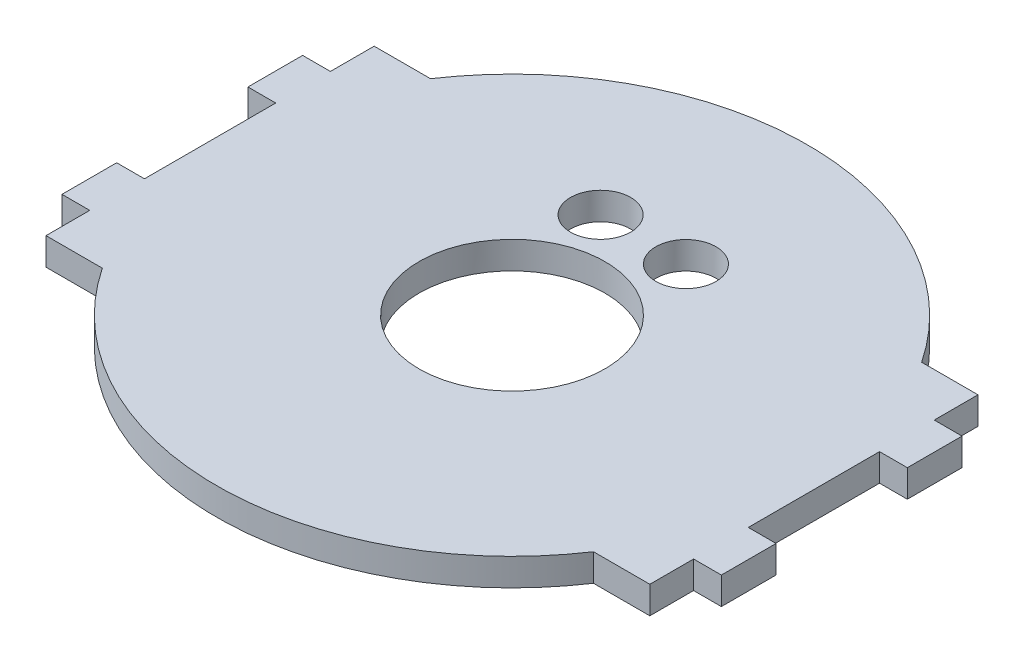
ISO-10303-21;
HEADER;
FILE_DESCRIPTION(('STEP AP214'),'2;1');
FILE_NAME('part.step','',(''),(''),'','','');
FILE_SCHEMA(('AUTOMOTIVE_DESIGN { 1 0 10303 214 1 1 1 1 }'));
ENDSEC;
DATA;
#1=APPLICATION_CONTEXT('core data for automotive mechanical design processes');
#2=APPLICATION_PROTOCOL_DEFINITION('international standard','automotive_design',2000,#1);
#3=PRODUCT_CONTEXT('',#1,'mechanical');
#4=PRODUCT('Part','Part','',(#3));
#5=PRODUCT_RELATED_PRODUCT_CATEGORY('part','',(#4));
#6=PRODUCT_DEFINITION_FORMATION('','',#4);
#7=PRODUCT_DEFINITION_CONTEXT('part definition',#1,'design');
#8=PRODUCT_DEFINITION('design','',#6,#7);
#9=PRODUCT_DEFINITION_SHAPE('','',#8);
#10=(LENGTH_UNIT() NAMED_UNIT(*) SI_UNIT(.MILLI.,.METRE.));
#11=(NAMED_UNIT(*) PLANE_ANGLE_UNIT() SI_UNIT($,.RADIAN.));
#12=(NAMED_UNIT(*) SI_UNIT($,.STERADIAN.) SOLID_ANGLE_UNIT());
#13=UNCERTAINTY_MEASURE_WITH_UNIT(LENGTH_MEASURE(1.E-05),#10,'distance_accuracy_value','');
#14=(GEOMETRIC_REPRESENTATION_CONTEXT(3) GLOBAL_UNCERTAINTY_ASSIGNED_CONTEXT((#13)) GLOBAL_UNIT_ASSIGNED_CONTEXT((#10,
#11,#12)) REPRESENTATION_CONTEXT('',''));
#15=CARTESIAN_POINT('',(0.,0.,0.));
#16=DIRECTION('',(0.,0.,1.));
#17=DIRECTION('',(1.,0.,0.));
#18=AXIS2_PLACEMENT_3D('',#15,#16,#17);
#19=CARTESIAN_POINT('',(35.052,3.175,19.05));
#20=DIRECTION('',(-1.,0.,0.));
#21=DIRECTION('',(0.,0.,1.));
#22=AXIS2_PLACEMENT_3D('',#19,#20,#21);
#23=PLANE('',#22);
#24=DIRECTION('',(0.,1.,0.));
#25=VECTOR('',#24,1.);
#26=CARTESIAN_POINT('',(35.052,0.,7.62));
#27=LINE('',#26,#25);
#28=CARTESIAN_POINT('',(35.052,0.,7.62));
#29=VERTEX_POINT('',#28);
#30=CARTESIAN_POINT('',(35.052,3.175,7.62000000000001));
#31=VERTEX_POINT('',#30);
#32=EDGE_CURVE('E213',#29,#31,#27,.T.);
#33=ORIENTED_EDGE('',*,*,#32,.F.);
#34=DIRECTION('',(0.,0.,-1.));
#35=VECTOR('',#34,1.);
#36=CARTESIAN_POINT('',(35.052,0.,19.05));
#37=LINE('',#36,#35);
#38=CARTESIAN_POINT('',(35.052,0.,-7.62));
#39=VERTEX_POINT('',#38);
#40=EDGE_CURVE('E201',#29,#39,#37,.T.);
#41=ORIENTED_EDGE('',*,*,#40,.T.);
#42=DIRECTION('',(0.,1.,0.));
#43=VECTOR('',#42,1.);
#44=CARTESIAN_POINT('',(35.052,0.,-7.62));
#45=LINE('',#44,#43);
#46=CARTESIAN_POINT('',(35.052,3.175,-7.61999999999999));
#47=VERTEX_POINT('',#46);
#48=EDGE_CURVE('E426',#39,#47,#45,.T.);
#49=ORIENTED_EDGE('',*,*,#48,.T.);
#50=DIRECTION('',(0.,0.,-1.));
#51=VECTOR('',#50,1.);
#52=CARTESIAN_POINT('',(35.052,3.175,19.05));
#53=LINE('',#52,#51);
#54=EDGE_CURVE('E53',#31,#47,#53,.T.);
#55=ORIENTED_EDGE('',*,*,#54,.F.);
#56=EDGE_LOOP('',(#33,#41,#49,#55));
#57=FACE_BOUND('',#56,.T.);
#58=ADVANCED_FACE('F37',(#57),#23,.F.);
#59=DIRECTION('',(0.,1.,0.));
#60=VECTOR('',#59,1.);
#61=CARTESIAN_POINT('',(35.052,0.,13.97));
#62=LINE('',#61,#60);
#63=CARTESIAN_POINT('',(35.052,0.,13.97));
#64=VERTEX_POINT('',#63);
#65=CARTESIAN_POINT('',(35.052,3.175,13.97));
#66=VERTEX_POINT('',#65);
#67=EDGE_CURVE('E61',#64,#66,#62,.T.);
#68=ORIENTED_EDGE('',*,*,#67,.T.);
#69=CARTESIAN_POINT('',(35.052,3.175,19.05));
#70=VERTEX_POINT('',#69);
#71=EDGE_CURVE('E266',#70,#66,#53,.T.);
#72=ORIENTED_EDGE('',*,*,#71,.F.);
#73=DIRECTION('',(0.,-1.,0.));
#74=VECTOR('',#73,1.);
#75=CARTESIAN_POINT('',(35.052,3.175,19.05));
#76=LINE('',#75,#74);
#77=CARTESIAN_POINT('',(35.052,0.,19.05));
#78=VERTEX_POINT('',#77);
#79=EDGE_CURVE('E282',#70,#78,#76,.T.);
#80=ORIENTED_EDGE('',*,*,#79,.T.);
#81=EDGE_CURVE('E210',#78,#64,#37,.T.);
#82=ORIENTED_EDGE('',*,*,#81,.T.);
#83=EDGE_LOOP('',(#68,#72,#80,#82));
#84=FACE_BOUND('',#83,.T.);
#85=ADVANCED_FACE('F478',(#84),#23,.F.);
#86=DIRECTION('',(0.,1.,0.));
#87=VECTOR('',#86,1.);
#88=CARTESIAN_POINT('',(35.052,0.,-13.97));
#89=LINE('',#88,#87);
#90=CARTESIAN_POINT('',(35.052,0.,-13.97));
#91=VERTEX_POINT('',#90);
#92=CARTESIAN_POINT('',(35.052,3.175,-13.97));
#93=VERTEX_POINT('',#92);
#94=EDGE_CURVE('E495',#91,#93,#89,.T.);
#95=ORIENTED_EDGE('',*,*,#94,.F.);
#96=CARTESIAN_POINT('',(35.052,0.,-19.05));
#97=VERTEX_POINT('',#96);
#98=EDGE_CURVE('E211',#91,#97,#37,.T.);
#99=ORIENTED_EDGE('',*,*,#98,.T.);
#100=DIRECTION('',(0.,-1.,0.));
#101=VECTOR('',#100,1.);
#102=CARTESIAN_POINT('',(35.052,3.175,-19.05));
#103=LINE('',#102,#101);
#104=CARTESIAN_POINT('',(35.052,3.175,-19.05));
#105=VERTEX_POINT('',#104);
#106=EDGE_CURVE('E12',#105,#97,#103,.T.);
#107=ORIENTED_EDGE('',*,*,#106,.F.);
#108=EDGE_CURVE('E260',#93,#105,#53,.T.);
#109=ORIENTED_EDGE('',*,*,#108,.F.);
#110=EDGE_LOOP('',(#95,#99,#107,#109));
#111=FACE_BOUND('',#110,.T.);
#112=ADVANCED_FACE('F479',(#111),#23,.F.);
#113=CARTESIAN_POINT('',(-35.052,3.175,19.05));
#114=DIRECTION('',(1.,0.,0.));
#115=DIRECTION('',(0.,0.,-1.));
#116=AXIS2_PLACEMENT_3D('',#113,#114,#115);
#117=PLANE('',#116);
#118=DIRECTION('',(0.,0.,1.));
#119=VECTOR('',#118,1.);
#120=CARTESIAN_POINT('',(-35.052,0.,19.05));
#121=LINE('',#120,#119);
#122=CARTESIAN_POINT('',(-35.052,0.,-7.62));
#123=VERTEX_POINT('',#122);
#124=CARTESIAN_POINT('',(-35.052,0.,7.62000000000001));
#125=VERTEX_POINT('',#124);
#126=EDGE_CURVE('E547',#123,#125,#121,.T.);
#127=ORIENTED_EDGE('',*,*,#126,.T.);
#128=DIRECTION('',(0.,1.,0.));
#129=VECTOR('',#128,1.);
#130=CARTESIAN_POINT('',(-35.052,0.,7.62));
#131=LINE('',#130,#129);
#132=CARTESIAN_POINT('',(-35.052,3.175,7.62000000000001));
#133=VERTEX_POINT('',#132);
#134=EDGE_CURVE('E408',#125,#133,#131,.T.);
#135=ORIENTED_EDGE('',*,*,#134,.T.);
#136=DIRECTION('',(0.,0.,1.));
#137=VECTOR('',#136,1.);
#138=CARTESIAN_POINT('',(-35.052,3.175,19.05));
#139=LINE('',#138,#137);
#140=CARTESIAN_POINT('',(-35.052,3.175,-7.62));
#141=VERTEX_POINT('',#140);
#142=EDGE_CURVE('E512',#141,#133,#139,.T.);
#143=ORIENTED_EDGE('',*,*,#142,.F.);
#144=DIRECTION('',(0.,1.,0.));
#145=VECTOR('',#144,1.);
#146=CARTESIAN_POINT('',(-35.052,0.,-7.62));
#147=LINE('',#146,#145);
#148=EDGE_CURVE('E388',#123,#141,#147,.T.);
#149=ORIENTED_EDGE('',*,*,#148,.F.);
#150=EDGE_LOOP('',(#127,#135,#143,#149));
#151=FACE_BOUND('',#150,.T.);
#152=ADVANCED_FACE('F484',(#151),#117,.F.);
#153=CARTESIAN_POINT('',(-35.052,3.175,13.97));
#154=VERTEX_POINT('',#153);
#155=CARTESIAN_POINT('',(-35.052,3.175,19.05));
#156=VERTEX_POINT('',#155);
#157=EDGE_CURVE('E340',#154,#156,#139,.T.);
#158=ORIENTED_EDGE('',*,*,#157,.F.);
#159=DIRECTION('',(0.,1.,0.));
#160=VECTOR('',#159,1.);
#161=CARTESIAN_POINT('',(-35.052,0.,13.97));
#162=LINE('',#161,#160);
#163=CARTESIAN_POINT('',(-35.052,0.,13.97));
#164=VERTEX_POINT('',#163);
#165=EDGE_CURVE('E439',#164,#154,#162,.T.);
#166=ORIENTED_EDGE('',*,*,#165,.F.);
#167=CARTESIAN_POINT('',(-35.052,0.,19.05));
#168=VERTEX_POINT('',#167);
#169=EDGE_CURVE('E411',#164,#168,#121,.T.);
#170=ORIENTED_EDGE('',*,*,#169,.T.);
#171=DIRECTION('',(0.,-1.,0.));
#172=VECTOR('',#171,1.);
#173=CARTESIAN_POINT('',(-35.052,3.175,19.05));
#174=LINE('',#173,#172);
#175=EDGE_CURVE('E347',#156,#168,#174,.T.);
#176=ORIENTED_EDGE('',*,*,#175,.F.);
#177=EDGE_LOOP('',(#158,#166,#170,#176));
#178=FACE_BOUND('',#177,.T.);
#179=ADVANCED_FACE('F489',(#178),#117,.F.);
#180=CARTESIAN_POINT('',(-35.052,3.175,-19.05));
#181=DIRECTION('',(0.,0.,1.));
#182=DIRECTION('',(1.,0.,0.));
#183=AXIS2_PLACEMENT_3D('',#180,#181,#182);
#184=PLANE('',#183);
#185=DIRECTION('',(-1.,0.,0.));
#186=VECTOR('',#185,1.);
#187=CARTESIAN_POINT('',(-35.052,0.,-19.05));
#188=LINE('',#187,#186);
#189=CARTESIAN_POINT('',(28.5114292872174,0.,-19.05));
#190=VERTEX_POINT('',#189);
#191=EDGE_CURVE('E507',#97,#190,#188,.T.);
#192=ORIENTED_EDGE('',*,*,#191,.T.);
#193=DIRECTION('',(0.,1.,0.));
#194=VECTOR('',#193,1.);
#195=CARTESIAN_POINT('',(28.5114292872174,0.,-19.05));
#196=LINE('',#195,#194);
#197=CARTESIAN_POINT('',(28.5114292872174,3.175,-19.05));
#198=VERTEX_POINT('',#197);
#199=EDGE_CURVE('E253',#190,#198,#196,.T.);
#200=ORIENTED_EDGE('',*,*,#199,.T.);
#201=DIRECTION('',(-1.,0.,0.));
#202=VECTOR('',#201,1.);
#203=CARTESIAN_POINT('',(-35.052,3.175,-19.05));
#204=LINE('',#203,#202);
#205=EDGE_CURVE('E255',#105,#198,#204,.T.);
#206=ORIENTED_EDGE('',*,*,#205,.F.);
#207=ORIENTED_EDGE('',*,*,#106,.T.);
#208=EDGE_LOOP('',(#192,#200,#206,#207));
#209=FACE_BOUND('',#208,.T.);
#210=ADVANCED_FACE('F606',(#209),#184,.F.);
#211=CARTESIAN_POINT('',(-35.052,3.175,19.05));
#212=DIRECTION('',(0.,0.,-1.));
#213=DIRECTION('',(-1.,0.,0.));
#214=AXIS2_PLACEMENT_3D('',#211,#212,#213);
#215=PLANE('',#214);
#216=DIRECTION('',(1.,0.,0.));
#217=VECTOR('',#216,1.);
#218=CARTESIAN_POINT('',(-35.052,0.,19.05));
#219=LINE('',#218,#217);
#220=CARTESIAN_POINT('',(-28.5114292872174,0.,19.05));
#221=VERTEX_POINT('',#220);
#222=EDGE_CURVE('E350',#168,#221,#219,.T.);
#223=ORIENTED_EDGE('',*,*,#222,.T.);
#224=DIRECTION('',(0.,1.,0.));
#225=VECTOR('',#224,1.);
#226=CARTESIAN_POINT('',(-28.5114292872174,0.,19.05));
#227=LINE('',#226,#225);
#228=CARTESIAN_POINT('',(-28.5114292872174,3.175,19.05));
#229=VERTEX_POINT('',#228);
#230=EDGE_CURVE('E349',#221,#229,#227,.T.);
#231=ORIENTED_EDGE('',*,*,#230,.T.);
#232=DIRECTION('',(1.,0.,0.));
#233=VECTOR('',#232,1.);
#234=CARTESIAN_POINT('',(-35.052,3.175,19.05));
#235=LINE('',#234,#233);
#236=EDGE_CURVE('E277',#156,#229,#235,.T.);
#237=ORIENTED_EDGE('',*,*,#236,.F.);
#238=ORIENTED_EDGE('',*,*,#175,.T.);
#239=EDGE_LOOP('',(#223,#231,#237,#238));
#240=FACE_BOUND('',#239,.T.);
#241=ADVANCED_FACE('F346',(#240),#215,.F.);
#242=CARTESIAN_POINT('',(-28.5114292872174,3.175,-19.05));
#243=VERTEX_POINT('',#242);
#244=CARTESIAN_POINT('',(-35.052,3.175,-19.05));
#245=VERTEX_POINT('',#244);
#246=EDGE_CURVE('E517',#243,#245,#204,.T.);
#247=ORIENTED_EDGE('',*,*,#246,.F.);
#248=DIRECTION('',(0.,1.,0.));
#249=VECTOR('',#248,1.);
#250=CARTESIAN_POINT('',(-28.5114292872174,0.,-19.05));
#251=LINE('',#250,#249);
#252=CARTESIAN_POINT('',(-28.5114292872174,0.,-19.05));
#253=VERTEX_POINT('',#252);
#254=EDGE_CURVE('E353',#243,#253,#251,.F.);
#255=ORIENTED_EDGE('',*,*,#254,.T.);
#256=CARTESIAN_POINT('',(-35.052,0.,-19.05));
#257=VERTEX_POINT('',#256);
#258=EDGE_CURVE('E510',#253,#257,#188,.T.);
#259=ORIENTED_EDGE('',*,*,#258,.T.);
#260=DIRECTION('',(0.,-1.,0.));
#261=VECTOR('',#260,1.);
#262=CARTESIAN_POINT('',(-35.052,3.175,-19.05));
#263=LINE('',#262,#261);
#264=EDGE_CURVE('E45',#245,#257,#263,.T.);
#265=ORIENTED_EDGE('',*,*,#264,.F.);
#266=EDGE_LOOP('',(#247,#255,#259,#265));
#267=FACE_BOUND('',#266,.T.);
#268=ADVANCED_FACE('F611',(#267),#184,.F.);
#269=CARTESIAN_POINT('',(-35.052,0.,-13.97));
#270=VERTEX_POINT('',#269);
#271=EDGE_CURVE('E537',#257,#270,#121,.T.);
#272=ORIENTED_EDGE('',*,*,#271,.T.);
#273=DIRECTION('',(0.,1.,0.));
#274=VECTOR('',#273,1.);
#275=CARTESIAN_POINT('',(-35.052,0.,-13.97));
#276=LINE('',#275,#274);
#277=CARTESIAN_POINT('',(-35.052,3.175,-13.97));
#278=VERTEX_POINT('',#277);
#279=EDGE_CURVE('E382',#270,#278,#276,.T.);
#280=ORIENTED_EDGE('',*,*,#279,.T.);
#281=EDGE_CURVE('E461',#245,#278,#139,.T.);
#282=ORIENTED_EDGE('',*,*,#281,.F.);
#283=ORIENTED_EDGE('',*,*,#264,.T.);
#284=EDGE_LOOP('',(#272,#280,#282,#283));
#285=FACE_BOUND('',#284,.T.);
#286=ADVANCED_FACE('F492',(#285),#117,.F.);
#287=CARTESIAN_POINT('',(28.5114292872174,3.175,19.05));
#288=VERTEX_POINT('',#287);
#289=EDGE_CURVE('E283',#288,#70,#235,.T.);
#290=ORIENTED_EDGE('',*,*,#289,.F.);
#291=DIRECTION('',(0.,1.,0.));
#292=VECTOR('',#291,1.);
#293=CARTESIAN_POINT('',(28.5114292872174,0.,19.05));
#294=LINE('',#293,#292);
#295=CARTESIAN_POINT('',(28.5114292872174,0.,19.05));
#296=VERTEX_POINT('',#295);
#297=EDGE_CURVE('E354',#288,#296,#294,.F.);
#298=ORIENTED_EDGE('',*,*,#297,.T.);
#299=EDGE_CURVE('E535',#296,#78,#219,.T.);
#300=ORIENTED_EDGE('',*,*,#299,.T.);
#301=ORIENTED_EDGE('',*,*,#79,.F.);
#302=EDGE_LOOP('',(#290,#298,#300,#301));
#303=FACE_BOUND('',#302,.T.);
#304=ADVANCED_FACE('F331',(#303),#215,.F.);
#305=CARTESIAN_POINT('',(35.052,3.175,-19.05));
#306=DIRECTION('',(0.,-1.,0.));
#307=DIRECTION('',(0.,0.,-1.));
#308=AXIS2_PLACEMENT_3D('',#305,#306,#307);
#309=PLANE('',#308);
#310=CARTESIAN_POINT('',(-4.95500000000004,3.175,-15.24));
#311=DIRECTION('',(0.,1.,0.));
#312=DIRECTION('',(0.,0.,1.));
#313=AXIS2_PLACEMENT_3D('',#310,#311,#312);
#314=CIRCLE('',#313,3.4925);
#315=CARTESIAN_POINT('',(-4.95500000000004,3.175,-11.7475));
#316=VERTEX_POINT('',#315);
#317=EDGE_CURVE('E297',#316,#316,#314,.T.);
#318=ORIENTED_EDGE('',*,*,#317,.F.);
#319=EDGE_LOOP('',(#318));
#320=FACE_BOUND('',#319,.T.);
#321=CARTESIAN_POINT('',(4.95499999999996,3.175,-15.24));
#322=DIRECTION('',(0.,1.,0.));
#323=DIRECTION('',(0.,0.,1.));
#324=AXIS2_PLACEMENT_3D('',#321,#322,#323);
#325=CIRCLE('',#324,3.4925);
#326=CARTESIAN_POINT('',(4.95499999999996,3.175,-11.7475));
#327=VERTEX_POINT('',#326);
#328=EDGE_CURVE('E292',#327,#327,#325,.T.);
#329=ORIENTED_EDGE('',*,*,#328,.F.);
#330=EDGE_LOOP('',(#329));
#331=FACE_BOUND('',#330,.T.);
#332=CARTESIAN_POINT('',(0.,3.175,0.));
#333=DIRECTION('',(0.,1.,0.));
#334=DIRECTION('',(0.,0.,1.));
#335=AXIS2_PLACEMENT_3D('',#332,#333,#334);
#336=CIRCLE('',#335,10.795);
#337=CARTESIAN_POINT('',(0.,3.175,10.795));
#338=VERTEX_POINT('',#337);
#339=EDGE_CURVE('E231',#338,#338,#336,.T.);
#340=ORIENTED_EDGE('',*,*,#339,.F.);
#341=EDGE_LOOP('',(#340));
#342=FACE_BOUND('',#341,.T.);
#343=ORIENTED_EDGE('',*,*,#236,.T.);
#344=CARTESIAN_POINT('',(0.,3.175,0.));
#345=DIRECTION('',(0.,1.,0.));
#346=DIRECTION('',(0.,0.,1.));
#347=AXIS2_PLACEMENT_3D('',#344,#345,#346);
#348=CIRCLE('',#347,34.29);
#349=EDGE_CURVE('E337',#229,#288,#348,.T.);
#350=ORIENTED_EDGE('',*,*,#349,.T.);
#351=ORIENTED_EDGE('',*,*,#289,.T.);
#352=ORIENTED_EDGE('',*,*,#71,.T.);
#353=DIRECTION('',(-1.,0.,0.));
#354=VECTOR('',#353,1.);
#355=CARTESIAN_POINT('',(35.052,3.175,13.97));
#356=LINE('',#355,#354);
#357=CARTESIAN_POINT('',(38.2778,3.175,13.97));
#358=VERTEX_POINT('',#357);
#359=EDGE_CURVE('E228',#358,#66,#356,.T.);
#360=ORIENTED_EDGE('',*,*,#359,.F.);
#361=DIRECTION('',(0.,0.,1.));
#362=VECTOR('',#361,1.);
#363=CARTESIAN_POINT('',(38.2778,3.175,7.62));
#364=LINE('',#363,#362);
#365=CARTESIAN_POINT('',(38.2778,3.175,7.62));
#366=VERTEX_POINT('',#365);
#367=EDGE_CURVE('E223',#366,#358,#364,.T.);
#368=ORIENTED_EDGE('',*,*,#367,.F.);
#369=DIRECTION('',(1.,0.,0.));
#370=VECTOR('',#369,1.);
#371=CARTESIAN_POINT('',(35.052,3.175,7.62));
#372=LINE('',#371,#370);
#373=EDGE_CURVE('E236',#31,#366,#372,.T.);
#374=ORIENTED_EDGE('',*,*,#373,.F.);
#375=ORIENTED_EDGE('',*,*,#54,.T.);
#376=DIRECTION('',(-1.,0.,0.));
#377=VECTOR('',#376,1.);
#378=CARTESIAN_POINT('',(35.052,3.175,-7.62));
#379=LINE('',#378,#377);
#380=CARTESIAN_POINT('',(38.2778,3.175,-7.62));
#381=VERTEX_POINT('',#380);
#382=EDGE_CURVE('E571',#381,#47,#379,.T.);
#383=ORIENTED_EDGE('',*,*,#382,.F.);
#384=DIRECTION('',(0.,0.,1.));
#385=VECTOR('',#384,1.);
#386=CARTESIAN_POINT('',(38.2778,3.175,-7.62));
#387=LINE('',#386,#385);
#388=CARTESIAN_POINT('',(38.2778,3.175,-13.97));
#389=VERTEX_POINT('',#388);
#390=EDGE_CURVE('E566',#389,#381,#387,.T.);
#391=ORIENTED_EDGE('',*,*,#390,.F.);
#392=DIRECTION('',(1.,0.,0.));
#393=VECTOR('',#392,1.);
#394=CARTESIAN_POINT('',(35.052,3.175,-13.97));
#395=LINE('',#394,#393);
#396=EDGE_CURVE('E570',#93,#389,#395,.T.);
#397=ORIENTED_EDGE('',*,*,#396,.F.);
#398=ORIENTED_EDGE('',*,*,#108,.T.);
#399=ORIENTED_EDGE('',*,*,#205,.T.);
#400=EDGE_CURVE('E363',#198,#243,#348,.T.);
#401=ORIENTED_EDGE('',*,*,#400,.T.);
#402=ORIENTED_EDGE('',*,*,#246,.T.);
#403=ORIENTED_EDGE('',*,*,#281,.T.);
#404=DIRECTION('',(-1.,0.,0.));
#405=VECTOR('',#404,1.);
#406=CARTESIAN_POINT('',(-35.052,3.175,-13.97));
#407=LINE('',#406,#405);
#408=CARTESIAN_POINT('',(-38.2778,3.175,-13.97));
#409=VERTEX_POINT('',#408);
#410=EDGE_CURVE('E380',#278,#409,#407,.T.);
#411=ORIENTED_EDGE('',*,*,#410,.T.);
#412=DIRECTION('',(0.,0.,1.));
#413=VECTOR('',#412,1.);
#414=CARTESIAN_POINT('',(-38.2778,3.175,-7.62));
#415=LINE('',#414,#413);
#416=CARTESIAN_POINT('',(-38.2778,3.175,-7.62));
#417=VERTEX_POINT('',#416);
#418=EDGE_CURVE('E401',#409,#417,#415,.T.);
#419=ORIENTED_EDGE('',*,*,#418,.T.);
#420=DIRECTION('',(1.,0.,0.));
#421=VECTOR('',#420,1.);
#422=CARTESIAN_POINT('',(-35.052,3.175,-7.62));
#423=LINE('',#422,#421);
#424=EDGE_CURVE('E404',#417,#141,#423,.T.);
#425=ORIENTED_EDGE('',*,*,#424,.T.);
#426=ORIENTED_EDGE('',*,*,#142,.T.);
#427=DIRECTION('',(-1.,0.,0.));
#428=VECTOR('',#427,1.);
#429=CARTESIAN_POINT('',(-35.052,3.175,7.62));
#430=LINE('',#429,#428);
#431=CARTESIAN_POINT('',(-38.2778,3.175,7.62));
#432=VERTEX_POINT('',#431);
#433=EDGE_CURVE('E420',#133,#432,#430,.T.);
#434=ORIENTED_EDGE('',*,*,#433,.T.);
#435=DIRECTION('',(0.,0.,1.));
#436=VECTOR('',#435,1.);
#437=CARTESIAN_POINT('',(-38.2778,3.175,7.62));
#438=LINE('',#437,#436);
#439=CARTESIAN_POINT('',(-38.2778,3.175,13.97));
#440=VERTEX_POINT('',#439);
#441=EDGE_CURVE('E425',#432,#440,#438,.T.);
#442=ORIENTED_EDGE('',*,*,#441,.T.);
#443=DIRECTION('',(1.,0.,0.));
#444=VECTOR('',#443,1.);
#445=CARTESIAN_POINT('',(-35.052,3.175,13.97));
#446=LINE('',#445,#444);
#447=EDGE_CURVE('E433',#440,#154,#446,.T.);
#448=ORIENTED_EDGE('',*,*,#447,.T.);
#449=ORIENTED_EDGE('',*,*,#157,.T.);
#450=EDGE_LOOP('',(#343,#350,#351,#352,#360,#368,#374,#375,#383,#391,#397,#398,#399,#401,#402,
#403,#411,#419,#425,#426,#434,#442,#448,#449));
#451=FACE_BOUND('',#450,.T.);
#452=ADVANCED_FACE('F311',(#320,#331,#342,#451),#309,.F.);
#453=CARTESIAN_POINT('',(35.052,0.,-19.05));
#454=DIRECTION('',(0.,-1.,0.));
#455=DIRECTION('',(0.,0.,-1.));
#456=AXIS2_PLACEMENT_3D('',#453,#454,#455);
#457=PLANE('',#456);
#458=CARTESIAN_POINT('',(-4.95500000000004,0.,-15.24));
#459=DIRECTION('',(0.,-1.,0.));
#460=DIRECTION('',(0.,0.,-1.));
#461=AXIS2_PLACEMENT_3D('',#458,#459,#460);
#462=CIRCLE('',#461,3.4925);
#463=CARTESIAN_POINT('',(-4.95500000000004,0.,-18.7325));
#464=VERTEX_POINT('',#463);
#465=EDGE_CURVE('E40',#464,#464,#462,.T.);
#466=ORIENTED_EDGE('',*,*,#465,.F.);
#467=EDGE_LOOP('',(#466));
#468=FACE_BOUND('',#467,.T.);
#469=CARTESIAN_POINT('',(4.95499999999996,0.,-15.24));
#470=DIRECTION('',(0.,-1.,0.));
#471=DIRECTION('',(0.,0.,-1.));
#472=AXIS2_PLACEMENT_3D('',#469,#470,#471);
#473=CIRCLE('',#472,3.4925);
#474=CARTESIAN_POINT('',(4.95499999999996,0.,-18.7325));
#475=VERTEX_POINT('',#474);
#476=EDGE_CURVE('E296',#475,#475,#473,.T.);
#477=ORIENTED_EDGE('',*,*,#476,.F.);
#478=EDGE_LOOP('',(#477));
#479=FACE_BOUND('',#478,.T.);
#480=CARTESIAN_POINT('',(0.,0.,0.));
#481=DIRECTION('',(0.,-1.,0.));
#482=DIRECTION('',(0.,0.,-1.));
#483=AXIS2_PLACEMENT_3D('',#480,#481,#482);
#484=CIRCLE('',#483,10.795);
#485=CARTESIAN_POINT('',(0.,0.,-10.795));
#486=VERTEX_POINT('',#485);
#487=EDGE_CURVE('E240',#486,#486,#484,.T.);
#488=ORIENTED_EDGE('',*,*,#487,.F.);
#489=EDGE_LOOP('',(#488));
#490=FACE_BOUND('',#489,.T.);
#491=ORIENTED_EDGE('',*,*,#258,.F.);
#492=CARTESIAN_POINT('',(0.,0.,0.));
#493=DIRECTION('',(0.,1.,0.));
#494=DIRECTION('',(0.,0.,1.));
#495=AXIS2_PLACEMENT_3D('',#492,#493,#494);
#496=CIRCLE('',#495,34.29);
#497=EDGE_CURVE('E358',#190,#253,#496,.T.);
#498=ORIENTED_EDGE('',*,*,#497,.F.);
#499=ORIENTED_EDGE('',*,*,#191,.F.);
#500=ORIENTED_EDGE('',*,*,#98,.F.);
#501=DIRECTION('',(1.,0.,0.));
#502=VECTOR('',#501,1.);
#503=CARTESIAN_POINT('',(35.052,0.,-13.97));
#504=LINE('',#503,#502);
#505=CARTESIAN_POINT('',(38.2778,0.,-13.97));
#506=VERTEX_POINT('',#505);
#507=EDGE_CURVE('E503',#91,#506,#504,.T.);
#508=ORIENTED_EDGE('',*,*,#507,.T.);
#509=DIRECTION('',(0.,0.,1.));
#510=VECTOR('',#509,1.);
#511=CARTESIAN_POINT('',(38.2778,0.,-7.62));
#512=LINE('',#511,#510);
#513=CARTESIAN_POINT('',(38.2778,0.,-7.62));
#514=VERTEX_POINT('',#513);
#515=EDGE_CURVE('E564',#506,#514,#512,.T.);
#516=ORIENTED_EDGE('',*,*,#515,.T.);
#517=DIRECTION('',(-1.,0.,0.));
#518=VECTOR('',#517,1.);
#519=CARTESIAN_POINT('',(35.052,0.,-7.62));
#520=LINE('',#519,#518);
#521=EDGE_CURVE('E208',#514,#39,#520,.T.);
#522=ORIENTED_EDGE('',*,*,#521,.T.);
#523=ORIENTED_EDGE('',*,*,#40,.F.);
#524=DIRECTION('',(1.,0.,0.));
#525=VECTOR('',#524,1.);
#526=CARTESIAN_POINT('',(35.052,0.,7.62));
#527=LINE('',#526,#525);
#528=CARTESIAN_POINT('',(38.2778,0.,7.62));
#529=VERTEX_POINT('',#528);
#530=EDGE_CURVE('E205',#29,#529,#527,.T.);
#531=ORIENTED_EDGE('',*,*,#530,.T.);
#532=DIRECTION('',(0.,0.,1.));
#533=VECTOR('',#532,1.);
#534=CARTESIAN_POINT('',(38.2778,0.,7.62));
#535=LINE('',#534,#533);
#536=CARTESIAN_POINT('',(38.2778,0.,13.97));
#537=VERTEX_POINT('',#536);
#538=EDGE_CURVE('E217',#529,#537,#535,.T.);
#539=ORIENTED_EDGE('',*,*,#538,.T.);
#540=DIRECTION('',(-1.,0.,0.));
#541=VECTOR('',#540,1.);
#542=CARTESIAN_POINT('',(35.052,0.,13.97));
#543=LINE('',#542,#541);
#544=EDGE_CURVE('E222',#537,#64,#543,.T.);
#545=ORIENTED_EDGE('',*,*,#544,.T.);
#546=ORIENTED_EDGE('',*,*,#81,.F.);
#547=ORIENTED_EDGE('',*,*,#299,.F.);
#548=EDGE_CURVE('E365',#221,#296,#496,.T.);
#549=ORIENTED_EDGE('',*,*,#548,.F.);
#550=ORIENTED_EDGE('',*,*,#222,.F.);
#551=ORIENTED_EDGE('',*,*,#169,.F.);
#552=DIRECTION('',(1.,0.,0.));
#553=VECTOR('',#552,1.);
#554=CARTESIAN_POINT('',(-35.052,0.,13.97));
#555=LINE('',#554,#553);
#556=CARTESIAN_POINT('',(-38.2778,0.,13.97));
#557=VERTEX_POINT('',#556);
#558=EDGE_CURVE('E427',#557,#164,#555,.T.);
#559=ORIENTED_EDGE('',*,*,#558,.F.);
#560=DIRECTION('',(0.,0.,1.));
#561=VECTOR('',#560,1.);
#562=CARTESIAN_POINT('',(-38.2778,0.,7.62));
#563=LINE('',#562,#561);
#564=CARTESIAN_POINT('',(-38.2778,0.,7.62));
#565=VERTEX_POINT('',#564);
#566=EDGE_CURVE('E593',#565,#557,#563,.T.);
#567=ORIENTED_EDGE('',*,*,#566,.F.);
#568=DIRECTION('',(-1.,0.,0.));
#569=VECTOR('',#568,1.);
#570=CARTESIAN_POINT('',(-35.052,0.,7.62));
#571=LINE('',#570,#569);
#572=EDGE_CURVE('E437',#125,#565,#571,.T.);
#573=ORIENTED_EDGE('',*,*,#572,.F.);
#574=ORIENTED_EDGE('',*,*,#126,.F.);
#575=DIRECTION('',(1.,0.,0.));
#576=VECTOR('',#575,1.);
#577=CARTESIAN_POINT('',(-35.052,0.,-7.62));
#578=LINE('',#577,#576);
#579=CARTESIAN_POINT('',(-38.2778,0.,-7.62));
#580=VERTEX_POINT('',#579);
#581=EDGE_CURVE('E399',#580,#123,#578,.T.);
#582=ORIENTED_EDGE('',*,*,#581,.F.);
#583=DIRECTION('',(0.,0.,1.));
#584=VECTOR('',#583,1.);
#585=CARTESIAN_POINT('',(-38.2778,0.,-7.62));
#586=LINE('',#585,#584);
#587=CARTESIAN_POINT('',(-38.2778,0.,-13.97));
#588=VERTEX_POINT('',#587);
#589=EDGE_CURVE('E397',#588,#580,#586,.T.);
#590=ORIENTED_EDGE('',*,*,#589,.F.);
#591=DIRECTION('',(-1.,0.,0.));
#592=VECTOR('',#591,1.);
#593=CARTESIAN_POINT('',(-35.052,0.,-13.97));
#594=LINE('',#593,#592);
#595=EDGE_CURVE('E389',#270,#588,#594,.T.);
#596=ORIENTED_EDGE('',*,*,#595,.F.);
#597=ORIENTED_EDGE('',*,*,#271,.F.);
#598=EDGE_LOOP('',(#491,#498,#499,#500,#508,#516,#522,#523,#531,#539,#545,#546,#547,#549,#550,
#551,#559,#567,#573,#574,#582,#590,#596,#597));
#599=FACE_BOUND('',#598,.T.);
#600=ADVANCED_FACE('F203',(#468,#479,#490,#599),#457,.T.);
#601=CARTESIAN_POINT('',(0.,0.,0.));
#602=DIRECTION('',(0.,1.,0.));
#603=DIRECTION('',(0.,0.,1.));
#604=AXIS2_PLACEMENT_3D('',#601,#602,#603);
#605=CYLINDRICAL_SURFACE('',#604,34.29);
#606=ORIENTED_EDGE('',*,*,#230,.F.);
#607=ORIENTED_EDGE('',*,*,#548,.T.);
#608=ORIENTED_EDGE('',*,*,#297,.F.);
#609=ORIENTED_EDGE('',*,*,#349,.F.);
#610=EDGE_LOOP('',(#606,#607,#608,#609));
#611=FACE_BOUND('',#610,.T.);
#612=ADVANCED_FACE('F310',(#611),#605,.T.);
#613=ORIENTED_EDGE('',*,*,#199,.F.);
#614=ORIENTED_EDGE('',*,*,#497,.T.);
#615=ORIENTED_EDGE('',*,*,#254,.F.);
#616=ORIENTED_EDGE('',*,*,#400,.F.);
#617=EDGE_LOOP('',(#613,#614,#615,#616));
#618=FACE_BOUND('',#617,.T.);
#619=ADVANCED_FACE('F473',(#618),#605,.T.);
#620=CARTESIAN_POINT('',(-35.052,0.,-7.62));
#621=DIRECTION('',(0.,0.,1.));
#622=DIRECTION('',(1.,0.,0.));
#623=AXIS2_PLACEMENT_3D('',#620,#621,#622);
#624=PLANE('',#623);
#625=ORIENTED_EDGE('',*,*,#424,.F.);
#626=DIRECTION('',(0.,1.,0.));
#627=VECTOR('',#626,1.);
#628=CARTESIAN_POINT('',(-38.2778,0.,-7.62));
#629=LINE('',#628,#627);
#630=EDGE_CURVE('E364',#580,#417,#629,.T.);
#631=ORIENTED_EDGE('',*,*,#630,.F.);
#632=ORIENTED_EDGE('',*,*,#581,.T.);
#633=ORIENTED_EDGE('',*,*,#148,.T.);
#634=EDGE_LOOP('',(#625,#631,#632,#633));
#635=FACE_BOUND('',#634,.T.);
#636=ADVANCED_FACE('F465',(#635),#624,.T.);
#637=CARTESIAN_POINT('',(-38.2778,0.,-7.62));
#638=DIRECTION('',(-1.,0.,0.));
#639=DIRECTION('',(0.,0.,1.));
#640=AXIS2_PLACEMENT_3D('',#637,#638,#639);
#641=PLANE('',#640);
#642=ORIENTED_EDGE('',*,*,#418,.F.);
#643=DIRECTION('',(0.,1.,0.));
#644=VECTOR('',#643,1.);
#645=CARTESIAN_POINT('',(-38.2778,0.,-13.97));
#646=LINE('',#645,#644);
#647=EDGE_CURVE('E387',#588,#409,#646,.T.);
#648=ORIENTED_EDGE('',*,*,#647,.F.);
#649=ORIENTED_EDGE('',*,*,#589,.T.);
#650=ORIENTED_EDGE('',*,*,#630,.T.);
#651=EDGE_LOOP('',(#642,#648,#649,#650));
#652=FACE_BOUND('',#651,.T.);
#653=ADVANCED_FACE('F463',(#652),#641,.T.);
#654=CARTESIAN_POINT('',(-35.052,0.,-13.97));
#655=DIRECTION('',(0.,0.,-1.));
#656=DIRECTION('',(-1.,0.,0.));
#657=AXIS2_PLACEMENT_3D('',#654,#655,#656);
#658=PLANE('',#657);
#659=ORIENTED_EDGE('',*,*,#410,.F.);
#660=ORIENTED_EDGE('',*,*,#279,.F.);
#661=ORIENTED_EDGE('',*,*,#595,.T.);
#662=ORIENTED_EDGE('',*,*,#647,.T.);
#663=EDGE_LOOP('',(#659,#660,#661,#662));
#664=FACE_BOUND('',#663,.T.);
#665=ADVANCED_FACE('F456',(#664),#658,.T.);
#666=CARTESIAN_POINT('',(-35.052,0.,7.62));
#667=DIRECTION('',(0.,0.,-1.));
#668=DIRECTION('',(-1.,0.,0.));
#669=AXIS2_PLACEMENT_3D('',#666,#667,#668);
#670=PLANE('',#669);
#671=ORIENTED_EDGE('',*,*,#433,.F.);
#672=ORIENTED_EDGE('',*,*,#134,.F.);
#673=ORIENTED_EDGE('',*,*,#572,.T.);
#674=DIRECTION('',(0.,1.,0.));
#675=VECTOR('',#674,1.);
#676=CARTESIAN_POINT('',(-38.2778,0.,7.62));
#677=LINE('',#676,#675);
#678=EDGE_CURVE('E444',#565,#432,#677,.T.);
#679=ORIENTED_EDGE('',*,*,#678,.T.);
#680=EDGE_LOOP('',(#671,#672,#673,#679));
#681=FACE_BOUND('',#680,.T.);
#682=ADVANCED_FACE('F471',(#681),#670,.T.);
#683=CARTESIAN_POINT('',(-35.052,0.,13.97));
#684=DIRECTION('',(0.,0.,1.));
#685=DIRECTION('',(1.,0.,0.));
#686=AXIS2_PLACEMENT_3D('',#683,#684,#685);
#687=PLANE('',#686);
#688=ORIENTED_EDGE('',*,*,#447,.F.);
#689=DIRECTION('',(0.,1.,0.));
#690=VECTOR('',#689,1.);
#691=CARTESIAN_POINT('',(-38.2778,0.,13.97));
#692=LINE('',#691,#690);
#693=EDGE_CURVE('E442',#557,#440,#692,.T.);
#694=ORIENTED_EDGE('',*,*,#693,.F.);
#695=ORIENTED_EDGE('',*,*,#558,.T.);
#696=ORIENTED_EDGE('',*,*,#165,.T.);
#697=EDGE_LOOP('',(#688,#694,#695,#696));
#698=FACE_BOUND('',#697,.T.);
#699=ADVANCED_FACE('F601',(#698),#687,.T.);
#700=CARTESIAN_POINT('',(-38.2778,0.,7.62));
#701=DIRECTION('',(-1.,0.,0.));
#702=DIRECTION('',(0.,0.,1.));
#703=AXIS2_PLACEMENT_3D('',#700,#701,#702);
#704=PLANE('',#703);
#705=ORIENTED_EDGE('',*,*,#441,.F.);
#706=ORIENTED_EDGE('',*,*,#678,.F.);
#707=ORIENTED_EDGE('',*,*,#566,.T.);
#708=ORIENTED_EDGE('',*,*,#693,.T.);
#709=EDGE_LOOP('',(#705,#706,#707,#708));
#710=FACE_BOUND('',#709,.T.);
#711=ADVANCED_FACE('F629',(#710),#704,.T.);
#712=CARTESIAN_POINT('',(35.052,0.,-7.62));
#713=DIRECTION('',(0.,0.,-1.));
#714=DIRECTION('',(-1.,0.,0.));
#715=AXIS2_PLACEMENT_3D('',#712,#713,#714);
#716=PLANE('',#715);
#717=ORIENTED_EDGE('',*,*,#382,.T.);
#718=ORIENTED_EDGE('',*,*,#48,.F.);
#719=ORIENTED_EDGE('',*,*,#521,.F.);
#720=DIRECTION('',(0.,1.,0.));
#721=VECTOR('',#720,1.);
#722=CARTESIAN_POINT('',(38.2778,0.,-7.62));
#723=LINE('',#722,#721);
#724=EDGE_CURVE('E582',#514,#381,#723,.T.);
#725=ORIENTED_EDGE('',*,*,#724,.T.);
#726=EDGE_LOOP('',(#717,#718,#719,#725));
#727=FACE_BOUND('',#726,.T.);
#728=ADVANCED_FACE('F631',(#727),#716,.F.);
#729=CARTESIAN_POINT('',(35.052,0.,-13.97));
#730=DIRECTION('',(0.,0.,1.));
#731=DIRECTION('',(1.,0.,0.));
#732=AXIS2_PLACEMENT_3D('',#729,#730,#731);
#733=PLANE('',#732);
#734=ORIENTED_EDGE('',*,*,#396,.T.);
#735=DIRECTION('',(0.,1.,0.));
#736=VECTOR('',#735,1.);
#737=CARTESIAN_POINT('',(38.2778,0.,-13.97));
#738=LINE('',#737,#736);
#739=EDGE_CURVE('E501',#506,#389,#738,.T.);
#740=ORIENTED_EDGE('',*,*,#739,.F.);
#741=ORIENTED_EDGE('',*,*,#507,.F.);
#742=ORIENTED_EDGE('',*,*,#94,.T.);
#743=EDGE_LOOP('',(#734,#740,#741,#742));
#744=FACE_BOUND('',#743,.T.);
#745=ADVANCED_FACE('F637',(#744),#733,.F.);
#746=CARTESIAN_POINT('',(38.2778,0.,-7.62));
#747=DIRECTION('',(-1.,0.,0.));
#748=DIRECTION('',(0.,0.,1.));
#749=AXIS2_PLACEMENT_3D('',#746,#747,#748);
#750=PLANE('',#749);
#751=ORIENTED_EDGE('',*,*,#390,.T.);
#752=ORIENTED_EDGE('',*,*,#724,.F.);
#753=ORIENTED_EDGE('',*,*,#515,.F.);
#754=ORIENTED_EDGE('',*,*,#739,.T.);
#755=EDGE_LOOP('',(#751,#752,#753,#754));
#756=FACE_BOUND('',#755,.T.);
#757=ADVANCED_FACE('F685',(#756),#750,.F.);
#758=CARTESIAN_POINT('',(35.052,0.,7.62));
#759=DIRECTION('',(0.,0.,1.));
#760=DIRECTION('',(1.,0.,0.));
#761=AXIS2_PLACEMENT_3D('',#758,#759,#760);
#762=PLANE('',#761);
#763=ORIENTED_EDGE('',*,*,#373,.T.);
#764=DIRECTION('',(0.,1.,0.));
#765=VECTOR('',#764,1.);
#766=CARTESIAN_POINT('',(38.2778,0.,7.62));
#767=LINE('',#766,#765);
#768=EDGE_CURVE('E221',#529,#366,#767,.T.);
#769=ORIENTED_EDGE('',*,*,#768,.F.);
#770=ORIENTED_EDGE('',*,*,#530,.F.);
#771=ORIENTED_EDGE('',*,*,#32,.T.);
#772=EDGE_LOOP('',(#763,#769,#770,#771));
#773=FACE_BOUND('',#772,.T.);
#774=ADVANCED_FACE('F219',(#773),#762,.F.);
#775=CARTESIAN_POINT('',(38.2778,0.,7.62));
#776=DIRECTION('',(-1.,0.,0.));
#777=DIRECTION('',(0.,0.,1.));
#778=AXIS2_PLACEMENT_3D('',#775,#776,#777);
#779=PLANE('',#778);
#780=ORIENTED_EDGE('',*,*,#367,.T.);
#781=DIRECTION('',(0.,1.,0.));
#782=VECTOR('',#781,1.);
#783=CARTESIAN_POINT('',(38.2778,0.,13.97));
#784=LINE('',#783,#782);
#785=EDGE_CURVE('E559',#537,#358,#784,.T.);
#786=ORIENTED_EDGE('',*,*,#785,.F.);
#787=ORIENTED_EDGE('',*,*,#538,.F.);
#788=ORIENTED_EDGE('',*,*,#768,.T.);
#789=EDGE_LOOP('',(#780,#786,#787,#788));
#790=FACE_BOUND('',#789,.T.);
#791=ADVANCED_FACE('F703',(#790),#779,.F.);
#792=CARTESIAN_POINT('',(35.052,0.,13.97));
#793=DIRECTION('',(0.,0.,-1.));
#794=DIRECTION('',(-1.,0.,0.));
#795=AXIS2_PLACEMENT_3D('',#792,#793,#794);
#796=PLANE('',#795);
#797=ORIENTED_EDGE('',*,*,#359,.T.);
#798=ORIENTED_EDGE('',*,*,#67,.F.);
#799=ORIENTED_EDGE('',*,*,#544,.F.);
#800=ORIENTED_EDGE('',*,*,#785,.T.);
#801=EDGE_LOOP('',(#797,#798,#799,#800));
#802=FACE_BOUND('',#801,.T.);
#803=ADVANCED_FACE('F558',(#802),#796,.F.);
#804=CARTESIAN_POINT('',(0.,-5.00000000001367E-05,0.));
#805=DIRECTION('',(0.,1.,0.));
#806=DIRECTION('',(0.,0.,1.));
#807=AXIS2_PLACEMENT_3D('',#804,#805,#806);
#808=CYLINDRICAL_SURFACE('',#807,10.795);
#809=ORIENTED_EDGE('',*,*,#487,.T.);
#810=EDGE_LOOP('',(#809));
#811=FACE_BOUND('',#810,.T.);
#812=ORIENTED_EDGE('',*,*,#339,.T.);
#813=EDGE_LOOP('',(#812));
#814=FACE_BOUND('',#813,.T.);
#815=ADVANCED_FACE('F325',(#811,#814),#808,.F.);
#816=CARTESIAN_POINT('',(4.95499999999996,-5.00000000001367E-05,-15.24));
#817=DIRECTION('',(0.,1.,0.));
#818=DIRECTION('',(0.,0.,1.));
#819=AXIS2_PLACEMENT_3D('',#816,#817,#818);
#820=CYLINDRICAL_SURFACE('',#819,3.4925);
#821=ORIENTED_EDGE('',*,*,#476,.T.);
#822=EDGE_LOOP('',(#821));
#823=FACE_BOUND('',#822,.T.);
#824=ORIENTED_EDGE('',*,*,#328,.T.);
#825=EDGE_LOOP('',(#824));
#826=FACE_BOUND('',#825,.T.);
#827=ADVANCED_FACE('F322',(#823,#826),#820,.F.);
#828=CARTESIAN_POINT('',(-4.95500000000004,-5.00000000001367E-05,-15.24));
#829=DIRECTION('',(0.,1.,0.));
#830=DIRECTION('',(0.,0.,1.));
#831=AXIS2_PLACEMENT_3D('',#828,#829,#830);
#832=CYLINDRICAL_SURFACE('',#831,3.4925);
#833=ORIENTED_EDGE('',*,*,#465,.T.);
#834=EDGE_LOOP('',(#833));
#835=FACE_BOUND('',#834,.T.);
#836=ORIENTED_EDGE('',*,*,#317,.T.);
#837=EDGE_LOOP('',(#836));
#838=FACE_BOUND('',#837,.T.);
#839=ADVANCED_FACE('F306',(#835,#838),#832,.F.);
#840=CLOSED_SHELL('',(#58,#85,#112,#152,#179,#210,#241,#268,#286,#304,#452,#600,#612,#619,#636,
#653,#665,#682,#699,#711,#728,#745,#757,#774,#791,#803,#815,#827,#839));
#841=MANIFOLD_SOLID_BREP('B2',#840);
#842=ADVANCED_BREP_SHAPE_REPRESENTATION('',(#18,#841),#14);
#843=SHAPE_DEFINITION_REPRESENTATION(#9,#842);
ENDSEC;
END-ISO-10303-21;
